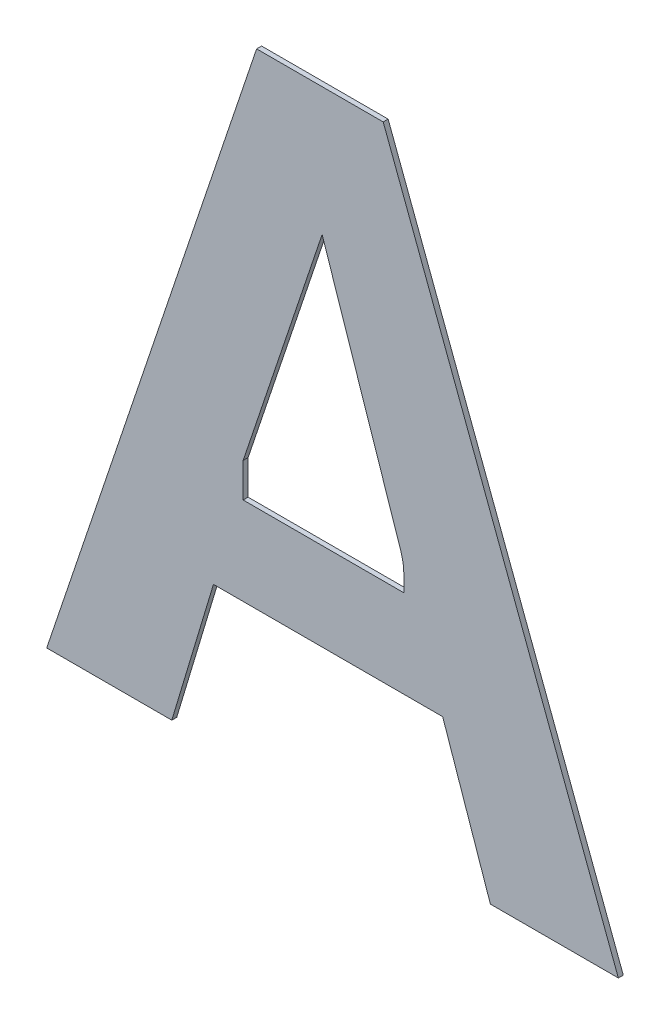
ISO-10303-21;
HEADER;
FILE_DESCRIPTION(('STEP AP214'),'2;1');
FILE_NAME('part.step','',(''),(''),'','','');
FILE_SCHEMA(('AUTOMOTIVE_DESIGN { 1 0 10303 214 1 1 1 1 }'));
ENDSEC;
DATA;
#1=APPLICATION_CONTEXT('core data for automotive mechanical design processes');
#2=APPLICATION_PROTOCOL_DEFINITION('international standard','automotive_design',2000,#1);
#3=PRODUCT_CONTEXT('',#1,'mechanical');
#4=PRODUCT('Part','Part','',(#3));
#5=PRODUCT_RELATED_PRODUCT_CATEGORY('part','',(#4));
#6=PRODUCT_DEFINITION_FORMATION('','',#4);
#7=PRODUCT_DEFINITION_CONTEXT('part definition',#1,'design');
#8=PRODUCT_DEFINITION('design','',#6,#7);
#9=PRODUCT_DEFINITION_SHAPE('','',#8);
#10=(LENGTH_UNIT() NAMED_UNIT(*) SI_UNIT(.MILLI.,.METRE.));
#11=(NAMED_UNIT(*) PLANE_ANGLE_UNIT() SI_UNIT($,.RADIAN.));
#12=(NAMED_UNIT(*) SI_UNIT($,.STERADIAN.) SOLID_ANGLE_UNIT());
#13=UNCERTAINTY_MEASURE_WITH_UNIT(LENGTH_MEASURE(1.E-05),#10,'distance_accuracy_value','');
#14=(GEOMETRIC_REPRESENTATION_CONTEXT(3) GLOBAL_UNCERTAINTY_ASSIGNED_CONTEXT((#13)) GLOBAL_UNIT_ASSIGNED_CONTEXT((#10,
#11,#12)) REPRESENTATION_CONTEXT('',''));
#15=CARTESIAN_POINT('',(0.,0.,0.));
#16=DIRECTION('',(0.,0.,1.));
#17=DIRECTION('',(1.,0.,0.));
#18=AXIS2_PLACEMENT_3D('',#15,#16,#17);
#19=CARTESIAN_POINT('',(-0.4578044807541,0.048062897260646,0.00086146168299));
#20=DIRECTION('',(-0.945478596235467,-0.325684239809989,0.));
#21=DIRECTION('',(0.,0.,1.));
#22=AXIS2_PLACEMENT_3D('',#19,#20,#21);
#23=PLANE('',#22);
#24=DIRECTION('',(0.,0.,1.));
#25=VECTOR('',#24,1.);
#26=CARTESIAN_POINT('',(-0.4520065075657,0.031231074037092,-0.00033853831701));
#27=LINE('',#26,#25);
#28=CARTESIAN_POINT('',(-0.4520065075657,0.031231074037092,-0.00033853831701));
#29=VERTEX_POINT('',#28);
#30=CARTESIAN_POINT('',(-0.4520065075657,0.031231074037092,0.00086146168299));
#31=VERTEX_POINT('',#30);
#32=EDGE_CURVE('E11',#29,#31,#27,.T.);
#33=ORIENTED_EDGE('',*,*,#32,.T.);
#34=DIRECTION('',(-0.325684239809989,0.945478596235467,0.));
#35=VECTOR('',#34,1.);
#36=CARTESIAN_POINT('',(-0.4520065075657,0.031231074037092,0.00086146168299));
#37=LINE('',#36,#35);
#38=CARTESIAN_POINT('',(-0.4636024539425,0.0648947204842,0.00086146168299));
#39=VERTEX_POINT('',#38);
#40=EDGE_CURVE('E24',#31,#39,#37,.T.);
#41=ORIENTED_EDGE('',*,*,#40,.T.);
#42=DIRECTION('',(0.,0.,1.));
#43=VECTOR('',#42,1.);
#44=CARTESIAN_POINT('',(-0.4636024539425,0.0648947204842,-0.00033853831701));
#45=LINE('',#44,#43);
#46=CARTESIAN_POINT('',(-0.4636024539425,0.0648947204842,-0.00033853831701));
#47=VERTEX_POINT('',#46);
#48=EDGE_CURVE('E224',#47,#39,#45,.T.);
#49=ORIENTED_EDGE('',*,*,#48,.F.);
#50=DIRECTION('',(-0.325684239809989,0.945478596235467,0.));
#51=VECTOR('',#50,1.);
#52=CARTESIAN_POINT('',(-0.4520065075657,0.031231074037092,-0.00033853831701));
#53=LINE('',#52,#51);
#54=EDGE_CURVE('E221',#29,#47,#53,.T.);
#55=ORIENTED_EDGE('',*,*,#54,.F.);
#56=EDGE_LOOP('',(#33,#41,#49,#55));
#57=FACE_BOUND('',#56,.T.);
#58=ADVANCED_FACE('F17',(#57),#23,.T.);
#59=CARTESIAN_POINT('',(-0.4914674047125,0.0648947204842,0.00086146168299));
#60=DIRECTION('',(0.,-1.,0.));
#61=DIRECTION('',(0.,0.,-1.));
#62=AXIS2_PLACEMENT_3D('',#59,#60,#61);
#63=PLANE('',#62);
#64=ORIENTED_EDGE('',*,*,#48,.T.);
#65=DIRECTION('',(-1.,0.,0.));
#66=VECTOR('',#65,1.);
#67=CARTESIAN_POINT('',(-0.4636024539425,0.0648947204842,0.00086146168299));
#68=LINE('',#67,#66);
#69=CARTESIAN_POINT('',(-0.5193323554825,0.0648947204842,0.00086146168299));
#70=VERTEX_POINT('',#69);
#71=EDGE_CURVE('E219',#39,#70,#68,.T.);
#72=ORIENTED_EDGE('',*,*,#71,.T.);
#73=DIRECTION('',(0.,0.,1.));
#74=VECTOR('',#73,1.);
#75=CARTESIAN_POINT('',(-0.5193323554825,0.0648947204842,-0.00033853831701));
#76=LINE('',#75,#74);
#77=CARTESIAN_POINT('',(-0.5193323554825,0.0648947204842,-0.00033853831701));
#78=VERTEX_POINT('',#77);
#79=EDGE_CURVE('E216',#78,#70,#76,.T.);
#80=ORIENTED_EDGE('',*,*,#79,.F.);
#81=DIRECTION('',(-1.,0.,0.));
#82=VECTOR('',#81,1.);
#83=CARTESIAN_POINT('',(-0.4636024539425,0.0648947204842,-0.00033853831701));
#84=LINE('',#83,#82);
#85=EDGE_CURVE('E213',#47,#78,#84,.T.);
#86=ORIENTED_EDGE('',*,*,#85,.F.);
#87=EDGE_LOOP('',(#64,#72,#80,#86));
#88=FACE_BOUND('',#87,.T.);
#89=ADVANCED_FACE('F231',(#88),#63,.T.);
#90=CARTESIAN_POINT('',(-0.5243951962449,0.048062897260646,0.00086146168299));
#91=DIRECTION('',(0.957617870270531,-0.288041688889875,0.));
#92=DIRECTION('',(0.,0.,-1.));
#93=AXIS2_PLACEMENT_3D('',#90,#91,#92);
#94=PLANE('',#93);
#95=ORIENTED_EDGE('',*,*,#79,.T.);
#96=DIRECTION('',(-0.288041688889875,-0.957617870270531,0.));
#97=VECTOR('',#96,1.);
#98=CARTESIAN_POINT('',(-0.5193323554825,0.0648947204842,0.00086146168299));
#99=LINE('',#98,#97);
#100=CARTESIAN_POINT('',(-0.5294580370073,0.031231074037092,0.00086146168299));
#101=VERTEX_POINT('',#100);
#102=EDGE_CURVE('E211',#70,#101,#99,.T.);
#103=ORIENTED_EDGE('',*,*,#102,.T.);
#104=DIRECTION('',(0.,0.,1.));
#105=VECTOR('',#104,1.);
#106=CARTESIAN_POINT('',(-0.5294580370073,0.031231074037092,-0.00033853831701));
#107=LINE('',#106,#105);
#108=CARTESIAN_POINT('',(-0.5294580370073,0.031231074037092,-0.00033853831701));
#109=VERTEX_POINT('',#108);
#110=EDGE_CURVE('E208',#109,#101,#107,.T.);
#111=ORIENTED_EDGE('',*,*,#110,.F.);
#112=DIRECTION('',(-0.288041688889875,-0.957617870270531,0.));
#113=VECTOR('',#112,1.);
#114=CARTESIAN_POINT('',(-0.5193323554825,0.0648947204842,-0.00033853831701));
#115=LINE('',#114,#113);
#116=EDGE_CURVE('E205',#78,#109,#115,.T.);
#117=ORIENTED_EDGE('',*,*,#116,.F.);
#118=EDGE_LOOP('',(#95,#103,#111,#117));
#119=FACE_BOUND('',#118,.T.);
#120=ADVANCED_FACE('F238',(#119),#94,.T.);
#121=CARTESIAN_POINT('',(-0.5446628152937,0.031231074037092,0.00086146168299));
#122=DIRECTION('',(0.,-1.,0.));
#123=DIRECTION('',(0.,0.,-1.));
#124=AXIS2_PLACEMENT_3D('',#121,#122,#123);
#125=PLANE('',#124);
#126=ORIENTED_EDGE('',*,*,#110,.T.);
#127=DIRECTION('',(-1.,0.,0.));
#128=VECTOR('',#127,1.);
#129=CARTESIAN_POINT('',(-0.5294580370073,0.031231074037092,0.00086146168299));
#130=LINE('',#129,#128);
#131=CARTESIAN_POINT('',(-0.5598675935801,0.031231074037092,0.00086146168299));
#132=VERTEX_POINT('',#131);
#133=EDGE_CURVE('E203',#101,#132,#130,.T.);
#134=ORIENTED_EDGE('',*,*,#133,.T.);
#135=DIRECTION('',(0.,0.,1.));
#136=VECTOR('',#135,1.);
#137=CARTESIAN_POINT('',(-0.5598675935801,0.031231074037092,-0.00033853831701));
#138=LINE('',#137,#136);
#139=CARTESIAN_POINT('',(-0.5598675935801,0.031231074037092,-0.00033853831701));
#140=VERTEX_POINT('',#139);
#141=EDGE_CURVE('E200',#140,#132,#138,.T.);
#142=ORIENTED_EDGE('',*,*,#141,.F.);
#143=DIRECTION('',(-1.,0.,0.));
#144=VECTOR('',#143,1.);
#145=CARTESIAN_POINT('',(-0.5294580370073,0.031231074037092,-0.00033853831701));
#146=LINE('',#145,#144);
#147=EDGE_CURVE('E197',#109,#140,#146,.T.);
#148=ORIENTED_EDGE('',*,*,#147,.F.);
#149=EDGE_LOOP('',(#126,#134,#142,#148));
#150=FACE_BOUND('',#149,.T.);
#151=ADVANCED_FACE('F242',(#150),#125,.T.);
#152=CARTESIAN_POINT('',(-0.5343525378625,0.107055919785846,0.00086146168299));
#153=DIRECTION('',(-0.947779080860672,0.318927599750945,0.));
#154=DIRECTION('',(0.,0.,1.));
#155=AXIS2_PLACEMENT_3D('',#152,#153,#154);
#156=PLANE('',#155);
#157=ORIENTED_EDGE('',*,*,#141,.T.);
#158=DIRECTION('',(0.318927599750945,0.947779080860672,0.));
#159=VECTOR('',#158,1.);
#160=CARTESIAN_POINT('',(-0.5598675935801,0.031231074037092,0.00086146168299));
#161=LINE('',#160,#159);
#162=CARTESIAN_POINT('',(-0.5088374821449,0.1828807655346,0.00086146168299));
#163=VERTEX_POINT('',#162);
#164=EDGE_CURVE('E195',#132,#163,#161,.T.);
#165=ORIENTED_EDGE('',*,*,#164,.T.);
#166=DIRECTION('',(0.,0.,1.));
#167=VECTOR('',#166,1.);
#168=CARTESIAN_POINT('',(-0.5088374821449,0.1828807655346,-0.00033853831701));
#169=LINE('',#168,#167);
#170=CARTESIAN_POINT('',(-0.5088374821449,0.1828807655346,-0.00033853831701));
#171=VERTEX_POINT('',#170);
#172=EDGE_CURVE('E192',#171,#163,#169,.T.);
#173=ORIENTED_EDGE('',*,*,#172,.F.);
#174=DIRECTION('',(0.318927599750945,0.947779080860672,0.));
#175=VECTOR('',#174,1.);
#176=CARTESIAN_POINT('',(-0.5598675935801,0.031231074037092,-0.00033853831701));
#177=LINE('',#176,#175);
#178=EDGE_CURVE('E189',#140,#171,#177,.T.);
#179=ORIENTED_EDGE('',*,*,#178,.F.);
#180=EDGE_LOOP('',(#157,#165,#173,#179));
#181=FACE_BOUND('',#180,.T.);
#182=ADVANCED_FACE('F247',(#181),#156,.T.);
#183=CARTESIAN_POINT('',(-0.4934520816407,0.1828807655346,0.00086146168299));
#184=DIRECTION('',(0.,1.,0.));
#185=DIRECTION('',(0.,0.,1.));
#186=AXIS2_PLACEMENT_3D('',#183,#184,#185);
#187=PLANE('',#186);
#188=ORIENTED_EDGE('',*,*,#172,.T.);
#189=DIRECTION('',(1.,0.,0.));
#190=VECTOR('',#189,1.);
#191=CARTESIAN_POINT('',(-0.5088374821449,0.1828807655346,0.00086146168299));
#192=LINE('',#191,#190);
#193=CARTESIAN_POINT('',(-0.4780666811365,0.1828807655346,0.00086146168299));
#194=VERTEX_POINT('',#193);
#195=EDGE_CURVE('E187',#163,#194,#192,.T.);
#196=ORIENTED_EDGE('',*,*,#195,.T.);
#197=DIRECTION('',(0.,0.,1.));
#198=VECTOR('',#197,1.);
#199=CARTESIAN_POINT('',(-0.4780666811365,0.1828807655346,-0.00033853831701));
#200=LINE('',#199,#198);
#201=CARTESIAN_POINT('',(-0.4780666811365,0.1828807655346,-0.00033853831701));
#202=VERTEX_POINT('',#201);
#203=EDGE_CURVE('E184',#202,#194,#200,.T.);
#204=ORIENTED_EDGE('',*,*,#203,.F.);
#205=DIRECTION('',(1.,0.,0.));
#206=VECTOR('',#205,1.);
#207=CARTESIAN_POINT('',(-0.5088374821449,0.1828807655346,-0.00033853831701));
#208=LINE('',#207,#206);
#209=EDGE_CURVE('E181',#171,#202,#208,.T.);
#210=ORIENTED_EDGE('',*,*,#209,.F.);
#211=EDGE_LOOP('',(#188,#196,#204,#210));
#212=FACE_BOUND('',#211,.T.);
#213=ADVANCED_FACE('F250',(#212),#187,.T.);
#214=CARTESIAN_POINT('',(-0.4494814089621,0.107055919785846,0.00086146168299));
#215=DIRECTION('',(0.935715306752695,0.352756098046101,0.));
#216=DIRECTION('',(0.,0.,-1.));
#217=AXIS2_PLACEMENT_3D('',#214,#215,#216);
#218=PLANE('',#217);
#219=ORIENTED_EDGE('',*,*,#203,.T.);
#220=DIRECTION('',(0.352756098046101,-0.935715306752695,0.));
#221=VECTOR('',#220,1.);
#222=CARTESIAN_POINT('',(-0.4780666811365,0.1828807655346,0.00086146168299));
#223=LINE('',#222,#221);
#224=CARTESIAN_POINT('',(-0.4208961367877,0.031231074037092,0.00086146168299));
#225=VERTEX_POINT('',#224);
#226=EDGE_CURVE('E179',#194,#225,#223,.T.);
#227=ORIENTED_EDGE('',*,*,#226,.T.);
#228=DIRECTION('',(0.,0.,1.));
#229=VECTOR('',#228,1.);
#230=CARTESIAN_POINT('',(-0.4208961367877,0.031231074037092,-0.00033853831701));
#231=LINE('',#230,#229);
#232=CARTESIAN_POINT('',(-0.4208961367877,0.031231074037092,-0.00033853831701));
#233=VERTEX_POINT('',#232);
#234=EDGE_CURVE('E176',#233,#225,#231,.T.);
#235=ORIENTED_EDGE('',*,*,#234,.F.);
#236=DIRECTION('',(0.352756098046101,-0.935715306752695,0.));
#237=VECTOR('',#236,1.);
#238=CARTESIAN_POINT('',(-0.4780666811365,0.1828807655346,-0.00033853831701));
#239=LINE('',#238,#237);
#240=EDGE_CURVE('E173',#202,#233,#239,.T.);
#241=ORIENTED_EDGE('',*,*,#240,.F.);
#242=EDGE_LOOP('',(#219,#227,#235,#241));
#243=FACE_BOUND('',#242,.T.);
#244=ADVANCED_FACE('F253',(#243),#218,.T.);
#245=CARTESIAN_POINT('',(-0.4364513221767,0.031231074037092,0.00086146168299));
#246=DIRECTION('',(0.,-1.,0.));
#247=DIRECTION('',(0.,0.,-1.));
#248=AXIS2_PLACEMENT_3D('',#245,#246,#247);
#249=PLANE('',#248);
#250=ORIENTED_EDGE('',*,*,#234,.T.);
#251=DIRECTION('',(-1.,0.,0.));
#252=VECTOR('',#251,1.);
#253=CARTESIAN_POINT('',(-0.4208961367877,0.031231074037092,0.00086146168299));
#254=LINE('',#253,#252);
#255=EDGE_CURVE('E171',#225,#31,#254,.T.);
#256=ORIENTED_EDGE('',*,*,#255,.T.);
#257=ORIENTED_EDGE('',*,*,#32,.F.);
#258=DIRECTION('',(-1.,0.,0.));
#259=VECTOR('',#258,1.);
#260=CARTESIAN_POINT('',(-0.4208961367877,0.031231074037092,-0.00033853831701));
#261=LINE('',#260,#259);
#262=EDGE_CURVE('E168',#233,#29,#261,.T.);
#263=ORIENTED_EDGE('',*,*,#262,.F.);
#264=EDGE_LOOP('',(#250,#256,#257,#263));
#265=FACE_BOUND('',#264,.T.);
#266=ADVANCED_FACE('F255',(#265),#249,.T.);
#267=CARTESIAN_POINT('',(-0.4833264001159,0.1231710340498,0.00086146168299));
#268=DIRECTION('',(-0.948088512389576,-0.318006560741945,0.));
#269=DIRECTION('',(0.,0.,1.));
#270=AXIS2_PLACEMENT_3D('',#267,#268,#269);
#271=PLANE('',#270);
#272=DIRECTION('',(0.,0.,1.));
#273=VECTOR('',#272,1.);
#274=CARTESIAN_POINT('',(-0.4737389728001,0.0945875680978,-0.00033853831701));
#275=LINE('',#274,#273);
#276=CARTESIAN_POINT('',(-0.4737389728001,0.0945875680978,-0.00033853831701));
#277=VERTEX_POINT('',#276);
#278=CARTESIAN_POINT('',(-0.4737389728001,0.0945875680978,0.00086146168299));
#279=VERTEX_POINT('',#278);
#280=EDGE_CURVE('E132',#277,#279,#275,.T.);
#281=ORIENTED_EDGE('',*,*,#280,.T.);
#282=DIRECTION('',(-0.318006560741945,0.948088512389576,0.));
#283=VECTOR('',#282,1.);
#284=CARTESIAN_POINT('',(-0.4737389728001,0.0945875680978,0.00086146168299));
#285=LINE('',#284,#283);
#286=CARTESIAN_POINT('',(-0.4929138274317,0.1517545000018,0.00086146168299));
#287=VERTEX_POINT('',#286);
#288=EDGE_CURVE('E165',#279,#287,#285,.T.);
#289=ORIENTED_EDGE('',*,*,#288,.T.);
#290=DIRECTION('',(0.,0.,1.));
#291=VECTOR('',#290,1.);
#292=CARTESIAN_POINT('',(-0.4929138274317,0.1517545000018,-0.00033853831701));
#293=LINE('',#292,#291);
#294=CARTESIAN_POINT('',(-0.4929138274317,0.1517545000018,-0.00033853831701));
#295=VERTEX_POINT('',#294);
#296=EDGE_CURVE('E162',#295,#287,#293,.T.);
#297=ORIENTED_EDGE('',*,*,#296,.F.);
#298=DIRECTION('',(-0.318006560741945,0.948088512389576,0.));
#299=VECTOR('',#298,1.);
#300=CARTESIAN_POINT('',(-0.4737389728001,0.0945875680978,-0.00033853831701));
#301=LINE('',#300,#299);
#302=EDGE_CURVE('E160',#277,#295,#301,.T.);
#303=ORIENTED_EDGE('',*,*,#302,.F.);
#304=EDGE_LOOP('',(#281,#289,#297,#303));
#305=FACE_BOUND('',#304,.T.);
#306=ADVANCED_FACE('F257',(#305),#271,.T.);
#307=CARTESIAN_POINT('',(-0.5025120920807,0.1231710340498,0.00086146168299));
#308=DIRECTION('',(0.947980091673513,-0.31832961814867,0.));
#309=DIRECTION('',(0.,0.,-1.));
#310=AXIS2_PLACEMENT_3D('',#307,#308,#309);
#311=PLANE('',#310);
#312=ORIENTED_EDGE('',*,*,#296,.T.);
#313=DIRECTION('',(-0.31832961814867,-0.947980091673513,0.));
#314=VECTOR('',#313,1.);
#315=CARTESIAN_POINT('',(-0.4929138274317,0.1517545000018,0.00086146168299));
#316=LINE('',#315,#314);
#317=CARTESIAN_POINT('',(-0.5121103567297,0.0945875680978,0.00086146168299));
#318=VERTEX_POINT('',#317);
#319=EDGE_CURVE('E158',#287,#318,#316,.T.);
#320=ORIENTED_EDGE('',*,*,#319,.T.);
#321=DIRECTION('',(0.,0.,1.));
#322=VECTOR('',#321,1.);
#323=CARTESIAN_POINT('',(-0.5121103567297,0.0945875680978,-0.00033853831701));
#324=LINE('',#323,#322);
#325=CARTESIAN_POINT('',(-0.5121103567297,0.0945875680978,-0.00033853831701));
#326=VERTEX_POINT('',#325);
#327=EDGE_CURVE('E155',#326,#318,#324,.T.);
#328=ORIENTED_EDGE('',*,*,#327,.F.);
#329=DIRECTION('',(-0.31832961814867,-0.947980091673513,0.));
#330=VECTOR('',#329,1.);
#331=CARTESIAN_POINT('',(-0.4929138274317,0.1517545000018,-0.00033853831701));
#332=LINE('',#331,#330);
#333=EDGE_CURVE('E153',#295,#326,#332,.T.);
#334=ORIENTED_EDGE('',*,*,#333,.F.);
#335=EDGE_LOOP('',(#312,#320,#328,#334));
#336=FACE_BOUND('',#335,.T.);
#337=ADVANCED_FACE('F264',(#336),#311,.T.);
#338=CARTESIAN_POINT('',(-0.5121103567297,0.090424587224,0.00086146168299));
#339=DIRECTION('',(1.,0.,0.));
#340=DIRECTION('',(0.,0.,-1.));
#341=AXIS2_PLACEMENT_3D('',#338,#339,#340);
#342=PLANE('',#341);
#343=ORIENTED_EDGE('',*,*,#327,.T.);
#344=DIRECTION('',(0.,-1.,0.));
#345=VECTOR('',#344,1.);
#346=CARTESIAN_POINT('',(-0.5121103567297,0.0945875680978,0.00086146168299));
#347=LINE('',#346,#345);
#348=CARTESIAN_POINT('',(-0.5121103567297,0.0862616063502,0.00086146168299));
#349=VERTEX_POINT('',#348);
#350=EDGE_CURVE('E151',#318,#349,#347,.T.);
#351=ORIENTED_EDGE('',*,*,#350,.T.);
#352=DIRECTION('',(0.,0.,1.));
#353=VECTOR('',#352,1.);
#354=CARTESIAN_POINT('',(-0.5121103567297,0.0862616063502,-0.00033853831701));
#355=LINE('',#354,#353);
#356=CARTESIAN_POINT('',(-0.5121103567297,0.0862616063502,-0.00033853831701));
#357=VERTEX_POINT('',#356);
#358=EDGE_CURVE('E149',#357,#349,#355,.T.);
#359=ORIENTED_EDGE('',*,*,#358,.F.);
#360=DIRECTION('',(0.,-1.,0.));
#361=VECTOR('',#360,1.);
#362=CARTESIAN_POINT('',(-0.5121103567297,0.0945875680978,-0.00033853831701));
#363=LINE('',#362,#361);
#364=EDGE_CURVE('E128',#326,#357,#363,.T.);
#365=ORIENTED_EDGE('',*,*,#364,.F.);
#366=EDGE_LOOP('',(#343,#351,#359,#365));
#367=FACE_BOUND('',#366,.T.);
#368=ADVANCED_FACE('F314',(#367),#342,.T.);
#369=CARTESIAN_POINT('',(-0.4925598078851,0.0862616063502,0.00086146168299));
#370=DIRECTION('',(0.,1.,0.));
#371=DIRECTION('',(0.,0.,1.));
#372=AXIS2_PLACEMENT_3D('',#369,#370,#371);
#373=PLANE('',#372);
#374=ORIENTED_EDGE('',*,*,#358,.T.);
#375=DIRECTION('',(1.,0.,0.));
#376=VECTOR('',#375,1.);
#377=CARTESIAN_POINT('',(-0.5121103567297,0.0862616063502,0.00086146168299));
#378=LINE('',#377,#376);
#379=CARTESIAN_POINT('',(-0.4730092590405,0.0862616063502,0.00086146168299));
#380=VERTEX_POINT('',#379);
#381=EDGE_CURVE('E114',#349,#380,#378,.T.);
#382=ORIENTED_EDGE('',*,*,#381,.T.);
#383=DIRECTION('',(0.,0.,1.));
#384=VECTOR('',#383,1.);
#385=CARTESIAN_POINT('',(-0.4730092590405,0.0862616063502,-0.00033853831701));
#386=LINE('',#385,#384);
#387=CARTESIAN_POINT('',(-0.4730092590405,0.0862616063502,-0.00033853831701));
#388=VERTEX_POINT('',#387);
#389=EDGE_CURVE('E108',#388,#380,#386,.T.);
#390=ORIENTED_EDGE('',*,*,#389,.F.);
#391=DIRECTION('',(1.,0.,0.));
#392=VECTOR('',#391,1.);
#393=CARTESIAN_POINT('',(-0.5121103567297,0.0862616063502,-0.00033853831701));
#394=LINE('',#393,#392);
#395=EDGE_CURVE('E112',#357,#388,#394,.T.);
#396=ORIENTED_EDGE('',*,*,#395,.F.);
#397=EDGE_LOOP('',(#374,#382,#390,#396));
#398=FACE_BOUND('',#397,.T.);
#399=ADVANCED_FACE('F111',(#398),#373,.T.);
#400=CARTESIAN_POINT('',(-0.4730092590405,0.0862616063502,0.00086146168299));
#401=CARTESIAN_POINT('',(-0.4730092590405,0.0862616063502,-0.00057853831701));
#402=CARTESIAN_POINT('',(-0.4730092590405,0.0913161384906,0.00086146168299));
#403=CARTESIAN_POINT('',(-0.4730092590405,0.0913161384906,-0.00057853831701));
#404=CARTESIAN_POINT('',(-0.4730092590405,0.0920501871834,0.00086146168299));
#405=CARTESIAN_POINT('',(-0.4730092590405,0.0920501871834,-0.00057853831701));
#406=CARTESIAN_POINT('',(-0.4737389728001,0.0945875680978,0.00086146168299));
#407=CARTESIAN_POINT('',(-0.4737389728001,0.0945875680978,-0.00057853831701));
#408=B_SPLINE_SURFACE_WITH_KNOTS('',3,1,((#400,#401),(#402,#403),(#404,#405),(#406,#407)),
.UNSPECIFIED.,.F.,.F.,.F.,(4,4),(2,2),(0.,1.),(0.,0.00036),.UNSPECIFIED.);
#409=CARTESIAN_POINT('',(-0.4730092590405,0.0862616063502,0.00086146168299));
#410=CARTESIAN_POINT('',(-0.4730092590405,0.0913161384906,0.00086146168299));
#411=CARTESIAN_POINT('',(-0.4730092590405,0.0920501871834,0.00086146168299));
#412=CARTESIAN_POINT('',(-0.4737389728001,0.0945875680978,0.00086146168299));
#413=B_SPLINE_CURVE_WITH_KNOTS('',3,(#409,#410,#411,#412),.UNSPECIFIED.,.F.,.F.,(4,4),(0.,1.),.UNSPECIFIED.);
#414=EDGE_CURVE('E129',#380,#279,#413,.T.);
#415=CARTESIAN_POINT('',(-0.4730092590405,0.0862616063502,-0.00033853831701));
#416=CARTESIAN_POINT('',(-0.4730092590405,0.0913161384906,-0.00033853831701));
#417=CARTESIAN_POINT('',(-0.4730092590405,0.0920501871834,-0.00033853831701));
#418=CARTESIAN_POINT('',(-0.4737389728001,0.0945875680978,-0.00033853831701));
#419=B_SPLINE_CURVE_WITH_KNOTS('',3,(#415,#416,#417,#418),.UNSPECIFIED.,.F.,.F.,(4,4),(0.,1.),.UNSPECIFIED.);
#420=EDGE_CURVE('E125',#388,#277,#419,.T.);
#421=ORIENTED_EDGE('',*,*,#389,.T.);
#422=ORIENTED_EDGE('',*,*,#414,.T.);
#423=ORIENTED_EDGE('',*,*,#280,.F.);
#424=ORIENTED_EDGE('',*,*,#420,.F.);
#425=EDGE_LOOP('',(#421,#422,#423,#424));
#426=FACE_BOUND('',#425,.T.);
#427=ADVANCED_FACE('F131',(#426),#408,.T.);
#428=CARTESIAN_POINT('',(-0.4903818651839,0.031231074037092,-0.00033853831701));
#429=DIRECTION('',(0.,0.,1.));
#430=DIRECTION('',(1.,0.,0.));
#431=AXIS2_PLACEMENT_3D('',#428,#429,#430);
#432=PLANE('',#431);
#433=ORIENTED_EDGE('',*,*,#54,.T.);
#434=ORIENTED_EDGE('',*,*,#85,.T.);
#435=ORIENTED_EDGE('',*,*,#116,.T.);
#436=ORIENTED_EDGE('',*,*,#147,.T.);
#437=ORIENTED_EDGE('',*,*,#178,.T.);
#438=ORIENTED_EDGE('',*,*,#209,.T.);
#439=ORIENTED_EDGE('',*,*,#240,.T.);
#440=ORIENTED_EDGE('',*,*,#262,.T.);
#441=EDGE_LOOP('',(#433,#434,#435,#436,#437,#438,#439,#440));
#442=FACE_BOUND('',#441,.T.);
#443=ORIENTED_EDGE('',*,*,#302,.T.);
#444=ORIENTED_EDGE('',*,*,#333,.T.);
#445=ORIENTED_EDGE('',*,*,#364,.T.);
#446=ORIENTED_EDGE('',*,*,#395,.T.);
#447=ORIENTED_EDGE('',*,*,#420,.T.);
#448=EDGE_LOOP('',(#443,#444,#445,#446,#447));
#449=FACE_BOUND('',#448,.T.);
#450=ADVANCED_FACE('F124',(#442,#449),#432,.F.);
#451=CARTESIAN_POINT('',(-0.4903818651839,0.031231074037092,0.00086146168299));
#452=DIRECTION('',(0.,0.,1.));
#453=DIRECTION('',(1.,0.,0.));
#454=AXIS2_PLACEMENT_3D('',#451,#452,#453);
#455=PLANE('',#454);
#456=ORIENTED_EDGE('',*,*,#40,.F.);
#457=ORIENTED_EDGE('',*,*,#255,.F.);
#458=ORIENTED_EDGE('',*,*,#226,.F.);
#459=ORIENTED_EDGE('',*,*,#195,.F.);
#460=ORIENTED_EDGE('',*,*,#164,.F.);
#461=ORIENTED_EDGE('',*,*,#133,.F.);
#462=ORIENTED_EDGE('',*,*,#102,.F.);
#463=ORIENTED_EDGE('',*,*,#71,.F.);
#464=EDGE_LOOP('',(#456,#457,#458,#459,#460,#461,#462,#463));
#465=FACE_BOUND('',#464,.T.);
#466=ORIENTED_EDGE('',*,*,#288,.F.);
#467=ORIENTED_EDGE('',*,*,#414,.F.);
#468=ORIENTED_EDGE('',*,*,#381,.F.);
#469=ORIENTED_EDGE('',*,*,#350,.F.);
#470=ORIENTED_EDGE('',*,*,#319,.F.);
#471=EDGE_LOOP('',(#466,#467,#468,#469,#470));
#472=FACE_BOUND('',#471,.T.);
#473=ADVANCED_FACE('F233',(#465,#472),#455,.T.);
#474=CLOSED_SHELL('',(#58,#89,#120,#151,#182,#213,#244,#266,#306,#337,#368,#399,#427,#450,#473));
#475=MANIFOLD_SOLID_BREP('B1',#474);
#476=ADVANCED_BREP_SHAPE_REPRESENTATION('',(#18,#475),#14);
#477=SHAPE_DEFINITION_REPRESENTATION(#9,#476);
ENDSEC;
END-ISO-10303-21;
